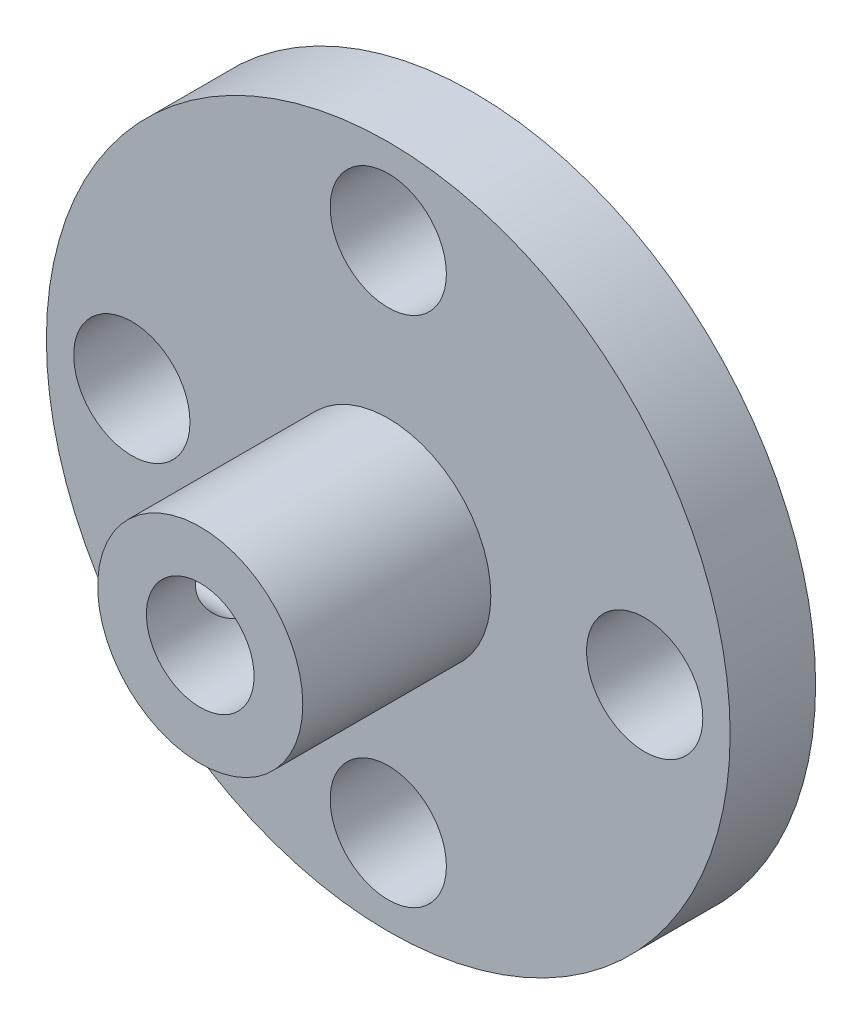
ISO-10303-21;
HEADER;
FILE_DESCRIPTION(('STEP AP214'),'2;1');
FILE_NAME('part.step','',(''),(''),'','','');
FILE_SCHEMA(('AUTOMOTIVE_DESIGN { 1 0 10303 214 1 1 1 1 }'));
ENDSEC;
DATA;
#1=APPLICATION_CONTEXT('core data for automotive mechanical design processes');
#2=APPLICATION_PROTOCOL_DEFINITION('international standard','automotive_design',2000,#1);
#3=PRODUCT_CONTEXT('',#1,'mechanical');
#4=PRODUCT('Part','Part','',(#3));
#5=PRODUCT_RELATED_PRODUCT_CATEGORY('part','',(#4));
#6=PRODUCT_DEFINITION_FORMATION('','',#4);
#7=PRODUCT_DEFINITION_CONTEXT('part definition',#1,'design');
#8=PRODUCT_DEFINITION('design','',#6,#7);
#9=PRODUCT_DEFINITION_SHAPE('','',#8);
#10=(LENGTH_UNIT() NAMED_UNIT(*) SI_UNIT(.MILLI.,.METRE.));
#11=(NAMED_UNIT(*) PLANE_ANGLE_UNIT() SI_UNIT($,.RADIAN.));
#12=(NAMED_UNIT(*) SI_UNIT($,.STERADIAN.) SOLID_ANGLE_UNIT());
#13=UNCERTAINTY_MEASURE_WITH_UNIT(LENGTH_MEASURE(1.E-05),#10,'distance_accuracy_value','');
#14=(GEOMETRIC_REPRESENTATION_CONTEXT(3) GLOBAL_UNCERTAINTY_ASSIGNED_CONTEXT((#13)) GLOBAL_UNIT_ASSIGNED_CONTEXT((#10,
#11,#12)) REPRESENTATION_CONTEXT('',''));
#15=CARTESIAN_POINT('',(0.,0.,0.));
#16=DIRECTION('',(0.,0.,1.));
#17=DIRECTION('',(1.,0.,0.));
#18=AXIS2_PLACEMENT_3D('',#15,#16,#17);
#19=CARTESIAN_POINT('',(0.,0.,3.175));
#20=DIRECTION('',(0.,0.,1.));
#21=DIRECTION('',(1.,0.,0.));
#22=AXIS2_PLACEMENT_3D('',#19,#20,#21);
#23=PLANE('',#22);
#24=CARTESIAN_POINT('',(0.,0.,3.175));
#25=DIRECTION('',(0.,0.,1.));
#26=DIRECTION('',(1.,0.,0.));
#27=AXIS2_PLACEMENT_3D('',#24,#25,#26);
#28=CIRCLE('',#27,12.7);
#29=CARTESIAN_POINT('',(12.7,0.,3.175));
#30=VERTEX_POINT('',#29);
#31=EDGE_CURVE('E11',#30,#30,#28,.T.);
#32=ORIENTED_EDGE('',*,*,#31,.T.);
#33=EDGE_LOOP('',(#32));
#34=FACE_BOUND('',#33,.T.);
#35=CARTESIAN_POINT('',(0.,9.525,3.175));
#36=DIRECTION('',(0.,0.,1.));
#37=DIRECTION('',(1.,0.,0.));
#38=AXIS2_PLACEMENT_3D('',#35,#36,#37);
#39=CIRCLE('',#38,2.159);
#40=CARTESIAN_POINT('',(2.159,9.525,3.175));
#41=VERTEX_POINT('',#40);
#42=EDGE_CURVE('E63',#41,#41,#39,.T.);
#43=ORIENTED_EDGE('',*,*,#42,.F.);
#44=EDGE_LOOP('',(#43));
#45=FACE_BOUND('',#44,.T.);
#46=CARTESIAN_POINT('',(9.52500000000027,2.68967068210316E-13,3.175));
#47=DIRECTION('',(0.,0.,1.));
#48=DIRECTION('',(1.,0.,0.));
#49=AXIS2_PLACEMENT_3D('',#46,#47,#48);
#50=CIRCLE('',#49,2.15900000000021);
#51=CARTESIAN_POINT('',(11.6840000000005,2.68967068210316E-13,3.175));
#52=VERTEX_POINT('',#51);
#53=EDGE_CURVE('E69',#52,#52,#50,.T.);
#54=ORIENTED_EDGE('',*,*,#53,.F.);
#55=EDGE_LOOP('',(#54));
#56=FACE_BOUND('',#55,.T.);
#57=CARTESIAN_POINT('',(5.37934136420633E-13,-9.525,3.175));
#58=DIRECTION('',(0.,0.,1.));
#59=DIRECTION('',(1.,0.,0.));
#60=AXIS2_PLACEMENT_3D('',#57,#58,#59);
#61=CIRCLE('',#60,2.15900000000058);
#62=CARTESIAN_POINT('',(2.15900000000112,-9.525,3.175));
#63=VERTEX_POINT('',#62);
#64=EDGE_CURVE('E97',#63,#63,#61,.T.);
#65=ORIENTED_EDGE('',*,*,#64,.F.);
#66=EDGE_LOOP('',(#65));
#67=FACE_BOUND('',#66,.T.);
#68=CARTESIAN_POINT('',(-9.52499999999973,-2.70133544286504E-13,3.175));
#69=DIRECTION('',(0.,0.,1.));
#70=DIRECTION('',(1.,0.,0.));
#71=AXIS2_PLACEMENT_3D('',#68,#69,#70);
#72=CIRCLE('',#71,2.15900000000043);
#73=CARTESIAN_POINT('',(-7.3659999999993,-2.70133544286504E-13,3.175));
#74=VERTEX_POINT('',#73);
#75=EDGE_CURVE('E92',#74,#74,#72,.T.);
#76=ORIENTED_EDGE('',*,*,#75,.F.);
#77=EDGE_LOOP('',(#76));
#78=FACE_BOUND('',#77,.T.);
#79=CARTESIAN_POINT('',(0.,0.,3.175));
#80=DIRECTION('',(0.,0.,1.));
#81=DIRECTION('',(1.,0.,0.));
#82=AXIS2_PLACEMENT_3D('',#79,#80,#81);
#83=CIRCLE('',#82,3.81);
#84=CARTESIAN_POINT('',(3.81,0.,3.175));
#85=VERTEX_POINT('',#84);
#86=EDGE_CURVE('E78',#85,#85,#83,.T.);
#87=ORIENTED_EDGE('',*,*,#86,.F.);
#88=EDGE_LOOP('',(#87));
#89=FACE_BOUND('',#88,.T.);
#90=ADVANCED_FACE('F49',(#34,#45,#56,#67,#78,#89),#23,.T.);
#91=CARTESIAN_POINT('',(0.,0.,0.));
#92=DIRECTION('',(0.,0.,1.));
#93=DIRECTION('',(1.,0.,0.));
#94=AXIS2_PLACEMENT_3D('',#91,#92,#93);
#95=PLANE('',#94);
#96=CARTESIAN_POINT('',(0.,0.,0.));
#97=DIRECTION('',(0.,0.,1.));
#98=DIRECTION('',(1.,0.,0.));
#99=AXIS2_PLACEMENT_3D('',#96,#97,#98);
#100=CIRCLE('',#99,12.7);
#101=CARTESIAN_POINT('',(12.7,0.,0.));
#102=VERTEX_POINT('',#101);
#103=EDGE_CURVE('E89',#102,#102,#100,.T.);
#104=ORIENTED_EDGE('',*,*,#103,.F.);
#105=EDGE_LOOP('',(#104));
#106=FACE_BOUND('',#105,.T.);
#107=CARTESIAN_POINT('',(0.,9.525,0.));
#108=DIRECTION('',(0.,0.,1.));
#109=DIRECTION('',(1.,0.,0.));
#110=AXIS2_PLACEMENT_3D('',#107,#108,#109);
#111=CIRCLE('',#110,2.159);
#112=CARTESIAN_POINT('',(2.159,9.525,0.));
#113=VERTEX_POINT('',#112);
#114=EDGE_CURVE('E86',#113,#113,#111,.T.);
#115=ORIENTED_EDGE('',*,*,#114,.T.);
#116=EDGE_LOOP('',(#115));
#117=FACE_BOUND('',#116,.T.);
#118=CARTESIAN_POINT('',(9.52500000000027,2.68967068210316E-13,0.));
#119=DIRECTION('',(0.,0.,1.));
#120=DIRECTION('',(1.,0.,0.));
#121=AXIS2_PLACEMENT_3D('',#118,#119,#120);
#122=CIRCLE('',#121,2.15900000000021);
#123=CARTESIAN_POINT('',(11.6840000000005,2.68967068210316E-13,0.));
#124=VERTEX_POINT('',#123);
#125=EDGE_CURVE('E82',#124,#124,#122,.T.);
#126=ORIENTED_EDGE('',*,*,#125,.T.);
#127=EDGE_LOOP('',(#126));
#128=FACE_BOUND('',#127,.T.);
#129=CARTESIAN_POINT('',(5.37934136420633E-13,-9.525,0.));
#130=DIRECTION('',(0.,0.,1.));
#131=DIRECTION('',(1.,0.,0.));
#132=AXIS2_PLACEMENT_3D('',#129,#130,#131);
#133=CIRCLE('',#132,2.15900000000058);
#134=CARTESIAN_POINT('',(2.15900000000112,-9.525,0.));
#135=VERTEX_POINT('',#134);
#136=EDGE_CURVE('E77',#135,#135,#133,.T.);
#137=ORIENTED_EDGE('',*,*,#136,.T.);
#138=EDGE_LOOP('',(#137));
#139=FACE_BOUND('',#138,.T.);
#140=CARTESIAN_POINT('',(-9.52499999999973,-2.70133544286504E-13,0.));
#141=DIRECTION('',(0.,0.,1.));
#142=DIRECTION('',(1.,0.,0.));
#143=AXIS2_PLACEMENT_3D('',#140,#141,#142);
#144=CIRCLE('',#143,2.15900000000043);
#145=CARTESIAN_POINT('',(-7.3659999999993,-2.70133544286504E-13,0.));
#146=VERTEX_POINT('',#145);
#147=EDGE_CURVE('E73',#146,#146,#144,.T.);
#148=ORIENTED_EDGE('',*,*,#147,.T.);
#149=EDGE_LOOP('',(#148));
#150=FACE_BOUND('',#149,.T.);
#151=CARTESIAN_POINT('',(0.,0.,0.));
#152=DIRECTION('',(0.,0.,1.));
#153=DIRECTION('',(1.,0.,0.));
#154=AXIS2_PLACEMENT_3D('',#151,#152,#153);
#155=CIRCLE('',#154,2.);
#156=CARTESIAN_POINT('',(2.,0.,0.));
#157=VERTEX_POINT('',#156);
#158=EDGE_CURVE('E133',#157,#157,#155,.T.);
#159=ORIENTED_EDGE('',*,*,#158,.T.);
#160=EDGE_LOOP('',(#159));
#161=FACE_BOUND('',#160,.T.);
#162=ADVANCED_FACE('F115',(#106,#117,#128,#139,#150,#161),#95,.F.);
#163=CARTESIAN_POINT('',(0.,9.525,3.175));
#164=DIRECTION('',(0.,0.,-1.));
#165=DIRECTION('',(-1.,0.,0.));
#166=AXIS2_PLACEMENT_3D('',#163,#164,#165);
#167=CYLINDRICAL_SURFACE('',#166,2.159);
#168=ORIENTED_EDGE('',*,*,#42,.T.);
#169=EDGE_LOOP('',(#168));
#170=FACE_BOUND('',#169,.T.);
#171=ORIENTED_EDGE('',*,*,#114,.F.);
#172=EDGE_LOOP('',(#171));
#173=FACE_BOUND('',#172,.T.);
#174=ADVANCED_FACE('F187',(#170,#173),#167,.F.);
#175=CARTESIAN_POINT('',(9.52500000000027,2.68967068210316E-13,3.175));
#176=DIRECTION('',(0.,0.,-1.));
#177=DIRECTION('',(-1.,0.,0.));
#178=AXIS2_PLACEMENT_3D('',#175,#176,#177);
#179=CYLINDRICAL_SURFACE('',#178,2.15900000000021);
#180=ORIENTED_EDGE('',*,*,#53,.T.);
#181=EDGE_LOOP('',(#180));
#182=FACE_BOUND('',#181,.T.);
#183=ORIENTED_EDGE('',*,*,#125,.F.);
#184=EDGE_LOOP('',(#183));
#185=FACE_BOUND('',#184,.T.);
#186=ADVANCED_FACE('F110',(#182,#185),#179,.F.);
#187=CARTESIAN_POINT('',(5.37934136420633E-13,-9.525,3.175));
#188=DIRECTION('',(0.,0.,-1.));
#189=DIRECTION('',(-1.,0.,0.));
#190=AXIS2_PLACEMENT_3D('',#187,#188,#189);
#191=CYLINDRICAL_SURFACE('',#190,2.15900000000058);
#192=ORIENTED_EDGE('',*,*,#64,.T.);
#193=EDGE_LOOP('',(#192));
#194=FACE_BOUND('',#193,.T.);
#195=ORIENTED_EDGE('',*,*,#136,.F.);
#196=EDGE_LOOP('',(#195));
#197=FACE_BOUND('',#196,.T.);
#198=ADVANCED_FACE('F184',(#194,#197),#191,.F.);
#199=CARTESIAN_POINT('',(-9.52499999999973,-2.70133544286504E-13,3.175));
#200=DIRECTION('',(0.,0.,-1.));
#201=DIRECTION('',(-1.,0.,0.));
#202=AXIS2_PLACEMENT_3D('',#199,#200,#201);
#203=CYLINDRICAL_SURFACE('',#202,2.15900000000043);
#204=ORIENTED_EDGE('',*,*,#75,.T.);
#205=EDGE_LOOP('',(#204));
#206=FACE_BOUND('',#205,.T.);
#207=ORIENTED_EDGE('',*,*,#147,.F.);
#208=EDGE_LOOP('',(#207));
#209=FACE_BOUND('',#208,.T.);
#210=ADVANCED_FACE('F51',(#206,#209),#203,.F.);
#211=CARTESIAN_POINT('',(0.,0.,3.175));
#212=DIRECTION('',(0.,0.,-1.));
#213=DIRECTION('',(-1.,0.,0.));
#214=AXIS2_PLACEMENT_3D('',#211,#212,#213);
#215=CYLINDRICAL_SURFACE('',#214,12.7);
#216=ORIENTED_EDGE('',*,*,#31,.F.);
#217=EDGE_LOOP('',(#216));
#218=FACE_BOUND('',#217,.T.);
#219=ORIENTED_EDGE('',*,*,#103,.T.);
#220=EDGE_LOOP('',(#219));
#221=FACE_BOUND('',#220,.T.);
#222=ADVANCED_FACE('F168',(#218,#221),#215,.T.);
#223=CARTESIAN_POINT('',(0.,0.,10.16));
#224=DIRECTION('',(0.,0.,-1.));
#225=DIRECTION('',(-1.,0.,0.));
#226=AXIS2_PLACEMENT_3D('',#223,#224,#225);
#227=CYLINDRICAL_SURFACE('',#226,2.);
#228=CARTESIAN_POINT('',(-2.,0.,8.335));
#229=CARTESIAN_POINT('',(-1.99999779170123,-0.0676282271040757,8.33499771331462));
#230=CARTESIAN_POINT('',(-1.99653849291545,-0.135277659027154,8.32988780934711));
#231=CARTESIAN_POINT('',(-1.9830373770726,-0.268425093843265,8.30976087565858));
#232=CARTESIAN_POINT('',(-1.97299028345689,-0.333921327913897,8.29473590430542));
#233=CARTESIAN_POINT('',(-1.94730383170857,-0.460618858768333,8.25571094861015));
#234=CARTESIAN_POINT('',(-1.93169181476083,-0.521839434022001,8.23175481824332));
#235=CARTESIAN_POINT('',(-1.8961212428857,-0.639128781225901,8.17589831626531));
#236=CARTESIAN_POINT('',(-1.87616226529362,-0.695197051451668,8.14399717209936));
#237=CARTESIAN_POINT('',(-1.83144422461706,-0.806028503427509,8.0701846937779));
#238=CARTESIAN_POINT('',(-1.80642024000079,-0.860266914399406,8.02764931355256));
#239=CARTESIAN_POINT('',(-1.75472774937108,-0.961332662708084,7.9352819444714));
#240=CARTESIAN_POINT('',(-1.7280568868781,-1.00814902177539,7.8854393529796));
#241=CARTESIAN_POINT('',(-1.67081342550614,-1.10081873784949,7.77049660944055));
#242=CARTESIAN_POINT('',(-1.64031016741129,-1.14528243433217,7.70423308271313));
#243=CARTESIAN_POINT('',(-1.58366940930257,-1.22240751214924,7.56347427809018));
#244=CARTESIAN_POINT('',(-1.55752441924661,-1.25508925654294,7.48899349619912));
#245=CARTESIAN_POINT('',(-1.52063899147661,-1.29931941189116,7.35598327389377));
#246=CARTESIAN_POINT('',(-1.50762947447479,-1.31425715875283,7.29921686527258));
#247=CARTESIAN_POINT('',(-1.48779848964415,-1.33666933815973,7.18321727543935));
#248=CARTESIAN_POINT('',(-1.48096611635565,-1.34415692597381,7.12398863537873));
#249=CARTESIAN_POINT('',(-1.47455099802662,-1.35119437276987,7.00438251712775));
#250=CARTESIAN_POINT('',(-1.47500082691156,-1.35070856592824,6.94400108439909));
#251=CARTESIAN_POINT('',(-1.48315319533032,-1.34174844845213,6.82431789680339));
#252=CARTESIAN_POINT('',(-1.49086102008152,-1.33326831640572,6.76501696082573));
#253=CARTESIAN_POINT('',(-1.51176576448829,-1.30950178176604,6.6520146788774));
#254=CARTESIAN_POINT('',(-1.52467333361019,-1.2945715445238,6.59818140362412));
#255=CARTESIAN_POINT('',(-1.55445372494255,-1.25865711084108,6.49373919190826));
#256=CARTESIAN_POINT('',(-1.57132959757272,-1.23766825432441,6.44313277415128));
#257=CARTESIAN_POINT('',(-1.6162777869568,-1.1788079681238,6.32215953534017));
#258=CARTESIAN_POINT('',(-1.64584272203452,-1.13766449285112,6.25392977314792));
#259=CARTESIAN_POINT('',(-1.70650325518769,-1.04448501661969,6.12603137335075));
#260=CARTESIAN_POINT('',(-1.73760155105273,-0.992429252698238,6.06637860438136));
#261=CARTESIAN_POINT('',(-1.79829635223503,-0.877711470793911,5.95616818703657));
#262=CARTESIAN_POINT('',(-1.82787885095596,-0.814967924663955,5.90568712736039));
#263=CARTESIAN_POINT('',(-1.88221497764854,-0.6800918987866,5.816025473977));
#264=CARTESIAN_POINT('',(-1.9069785053695,-0.607979186017681,5.77682163215482));
#265=CARTESIAN_POINT('',(-1.94428125162736,-0.472806880088533,5.71886334451706));
#266=CARTESIAN_POINT('',(-1.95831290266027,-0.411274629468529,5.69750351637255));
#267=CARTESIAN_POINT('',(-1.98065736207628,-0.284795243935582,5.66376369867151));
#268=CARTESIAN_POINT('',(-1.98897400584289,-0.219850430788237,5.65137768641707));
#269=CARTESIAN_POINT('',(-1.99915259880798,-0.0881207029273198,5.63624392538706));
#270=CARTESIAN_POINT('',(-2.00099379445717,-0.0213305619987398,5.63352716584268));
#271=CARTESIAN_POINT('',(-1.99798370769555,0.11176803940126,5.63798787724396));
#272=CARTESIAN_POINT('',(-1.99313195663853,0.178076465815762,5.64516604104114));
#273=CARTESIAN_POINT('',(-1.97760577751886,0.304885193982272,5.66837795058816));
#274=CARTESIAN_POINT('',(-1.96723636635373,0.365509897100455,5.68394831030888));
#275=CARTESIAN_POINT('',(-1.94170712217466,0.483112990273982,5.72288193403299));
#276=CARTESIAN_POINT('',(-1.92654641449173,0.54009071227373,5.7462466209631));
#277=CARTESIAN_POINT('',(-1.89107461360941,0.653974733101366,5.80213543828933));
#278=CARTESIAN_POINT('',(-1.87044114423664,0.710484978741783,5.83525751279239));
#279=CARTESIAN_POINT('',(-1.82625225659433,0.817408312640775,5.90863779522913));
#280=CARTESIAN_POINT('',(-1.80269451739019,0.867816494329826,5.94890168248845));
#281=CARTESIAN_POINT('',(-1.75016770369709,0.969912109903708,6.04300122195215));
#282=CARTESIAN_POINT('',(-1.72095005096077,1.0204193527657,6.09798031958262));
#283=CARTESIAN_POINT('',(-1.66329794845258,1.11191867803613,6.21577859787393));
#284=CARTESIAN_POINT('',(-1.6348637701157,1.15290749842426,6.27860045498777));
#285=CARTESIAN_POINT('',(-1.58591479837461,1.21914393627284,6.40163299292659));
#286=CARTESIAN_POINT('',(-1.5648509028817,1.24582446225904,6.46084949712787));
#287=CARTESIAN_POINT('',(-1.52804581172883,1.2907066123836,6.58394232472528));
#288=CARTESIAN_POINT('',(-1.51229420952745,1.30892484052073,6.6478092360646));
#289=CARTESIAN_POINT('',(-1.49040462854724,1.33376435408259,6.76874458456374));
#290=CARTESIAN_POINT('',(-1.48315262210532,1.34174842630907,6.82532590287263));
#291=CARTESIAN_POINT('',(-1.47524242523768,1.35044375433453,6.93948815152956));
#292=CARTESIAN_POINT('',(-1.47457903978374,1.35116074013065,6.99706825845328));
#293=CARTESIAN_POINT('',(-1.47994147670539,1.34528294055843,7.111465041456));
#294=CARTESIAN_POINT('',(-1.48596087967421,1.33869517205737,7.1682823972045));
#295=CARTESIAN_POINT('',(-1.50377847368539,1.31864533789349,7.27977768136163));
#296=CARTESIAN_POINT('',(-1.51558463681271,1.30517378775093,7.33445254564232));
#297=CARTESIAN_POINT('',(-1.54812054846541,1.26654898466073,7.45808930946022));
#298=CARTESIAN_POINT('',(-1.57050651130463,1.23901482226524,7.52586554218861));
#299=CARTESIAN_POINT('',(-1.61949032322796,1.17426514297033,7.65495230533347));
#300=CARTESIAN_POINT('',(-1.64609445047456,1.13703514120721,7.71625296748005));
#301=CARTESIAN_POINT('',(-1.70113617266383,1.05295301285826,7.83297266151239));
#302=CARTESIAN_POINT('',(-1.72959911857046,1.00593031198615,7.88825661631667));
#303=CARTESIAN_POINT('',(-1.78535455312654,0.90328436603997,7.99090532359869));
#304=CARTESIAN_POINT('',(-1.8126467374368,0.847658901778966,8.03826802611321));
#305=CARTESIAN_POINT('',(-1.86664983651361,0.721681434030674,8.12882961201791));
#306=CARTESIAN_POINT('',(-1.89295279599895,0.65037765508775,8.1709669268096));
#307=CARTESIAN_POINT('',(-1.93824300346185,0.499378379346407,8.241994645589));
#308=CARTESIAN_POINT('',(-1.95724724071721,0.41970292723455,8.27091584299636));
#309=CARTESIAN_POINT('',(-1.98069412894931,0.282721329013209,8.30626989937003));
#310=CARTESIAN_POINT('',(-1.98788795561871,0.226965641759603,8.31700056539478));
#311=CARTESIAN_POINT('',(-1.99754097338308,0.114144686625059,8.33136530714285));
#312=CARTESIAN_POINT('',(-2.00000186385878,0.0570798962331294,8.33500193001902));
#313=CARTESIAN_POINT('',(-2.,0.,8.335));
#314=B_SPLINE_CURVE_WITH_KNOTS('',3,(#228,#229,#230,#231,#232,#233,#234,#235,#236,#237,#238,
#239,#240,#241,#242,#243,#244,#245,#246,#247,#248,#249,#250,#251,#252,#253,#254,#255,#256,#257,
#258,#259,#260,#261,#262,#263,#264,#265,#266,#267,#268,#269,#270,#271,#272,#273,#274,#275,#276,
#277,#278,#279,#280,#281,#282,#283,#284,#285,#286,#287,#288,#289,#290,#291,#292,#293,#294,#295,
#296,#297,#298,#299,#300,#301,#302,#303,#304,#305,#306,#307,#308,#309,#310,#311,#312,#313),
.UNSPECIFIED.,.T.,.F.,(4,2,2,2,2,2,2,2,2,2,2,2,2,2,2,2,2,2,2,2,2,2,2,2,2,2,2,2,2,2,2,2,2,2,2,2,
2,2,2,2,2,2,4),(0.,0.202651464163277,0.405465442599549,0.607296401705931,0.809146994055782,
1.02831710184136,1.24780842813815,1.50292539701382,1.75759930234986,1.93726294016847,
2.11660876728147,2.29675704471727,2.477036606288,2.64842825957878,2.81995209416526,
3.07358269375797,3.32767666824589,3.58380364628826,3.83939876824866,4.03843994393392,
4.2373474108205,4.43689179006303,4.63645014229378,4.82597510880705,5.0155346938126,
5.2207800233876,5.42618930631758,5.66574299706562,5.90537866353734,6.10947965323964,
6.3131784638987,6.48520267545972,6.65709123774732,6.82881482868606,7.00077566105652,
7.22905726038459,7.45768187153473,7.69068363076875,7.92374559619129,8.1829279004951,
8.44150319435653,8.61260748921184,8.78365033686967),.UNSPECIFIED.);
#315=CARTESIAN_POINT('',(-2.,0.,8.335));
#316=VERTEX_POINT('',#315);
#317=EDGE_CURVE('E138',#316,#316,#314,.T.);
#318=ORIENTED_EDGE('',*,*,#317,.F.);
#319=EDGE_LOOP('',(#318));
#320=FACE_BOUND('',#319,.T.);
#321=CARTESIAN_POINT('',(0.,0.,10.16));
#322=DIRECTION('',(0.,0.,1.));
#323=DIRECTION('',(1.,0.,0.));
#324=AXIS2_PLACEMENT_3D('',#321,#322,#323);
#325=CIRCLE('',#324,2.);
#326=CARTESIAN_POINT('',(2.,0.,10.16));
#327=VERTEX_POINT('',#326);
#328=EDGE_CURVE('E127',#327,#327,#325,.T.);
#329=ORIENTED_EDGE('',*,*,#328,.T.);
#330=EDGE_LOOP('',(#329));
#331=FACE_BOUND('',#330,.T.);
#332=ORIENTED_EDGE('',*,*,#158,.F.);
#333=EDGE_LOOP('',(#332));
#334=FACE_BOUND('',#333,.T.);
#335=ADVANCED_FACE('F151',(#320,#331,#334),#227,.F.);
#336=CARTESIAN_POINT('',(0.,0.,10.16));
#337=DIRECTION('',(0.,0.,-1.));
#338=DIRECTION('',(-1.,0.,0.));
#339=AXIS2_PLACEMENT_3D('',#336,#337,#338);
#340=CYLINDRICAL_SURFACE('',#339,3.81);
#341=CARTESIAN_POINT('',(-3.81,0.,8.335));
#342=CARTESIAN_POINT('',(-3.81000097638546,-0.0733906685766089,8.33500137034603));
#343=CARTESIAN_POINT('',(-3.80786042556386,-0.14677156107298,8.32899621472365));
#344=CARTESIAN_POINT('',(-3.79953362163934,-0.291356058377059,8.30521927752224));
#345=CARTESIAN_POINT('',(-3.79334745508817,-0.362559709730467,8.28744774767246));
#346=CARTESIAN_POINT('',(-3.77759763849874,-0.500684395085561,8.24083480573473));
#347=CARTESIAN_POINT('',(-3.76804006956238,-0.567612885291789,8.21201331671848));
#348=CARTESIAN_POINT('',(-3.74651126619384,-0.695683685403511,8.14421420301865));
#349=CARTESIAN_POINT('',(-3.7345394651824,-0.756824632112393,8.105234193674));
#350=CARTESIAN_POINT('',(-3.70891462646797,-0.873940704912064,8.01665119089049));
#351=CARTESIAN_POINT('',(-3.69521763317504,-0.929662605680299,7.96672621913636));
#352=CARTESIAN_POINT('',(-3.66791512056369,-1.03214167961795,7.85835435787943));
#353=CARTESIAN_POINT('',(-3.65430962594648,-1.07889651891586,7.79990525673732));
#354=CARTESIAN_POINT('',(-3.62823353622555,-1.16363944028693,7.67376973148485));
#355=CARTESIAN_POINT('',(-3.61581570082831,-1.20128443875651,7.60584083124166));
#356=CARTESIAN_POINT('',(-3.59419692437244,-1.26450507911786,7.46410555711273));
#357=CARTESIAN_POINT('',(-3.58499485474922,-1.2900849563367,7.39030125637061));
#358=CARTESIAN_POINT('',(-3.57131578130404,-1.32747465909481,7.24180918267643));
#359=CARTESIAN_POINT('',(-3.56667498416927,-1.33976354978229,7.16725760256022));
#360=CARTESIAN_POINT('',(-3.56216178653321,-1.3517204820843,7.01701724281686));
#361=CARTESIAN_POINT('',(-3.56228767829303,-1.35139304369011,6.94132888017371));
#362=CARTESIAN_POINT('',(-3.56715122223268,-1.33849576284562,6.795190100443));
#363=CARTESIAN_POINT('',(-3.57164634307436,-1.32656972676471,6.72467334648524));
#364=CARTESIAN_POINT('',(-3.58434195324426,-1.29187093805301,6.58671562618508));
#365=CARTESIAN_POINT('',(-3.59254294098873,-1.26909672638724,6.51927507491663));
#366=CARTESIAN_POINT('',(-3.61188565133565,-1.21296063439395,6.38799595378979));
#367=CARTESIAN_POINT('',(-3.62307649098014,-1.17941983297647,6.32424144498645));
#368=CARTESIAN_POINT('',(-3.64711946785948,-1.1028270244331,6.20307034059894));
#369=CARTESIAN_POINT('',(-3.65997213244658,-1.05977199503826,6.14565576765585));
#370=CARTESIAN_POINT('',(-3.68682438783227,-0.962352827006063,6.03520222628202));
#371=CARTESIAN_POINT('',(-3.70084672338437,-0.907468291331746,5.982626742538));
#372=CARTESIAN_POINT('',(-3.72779522898407,-0.789493329468497,5.88729676894652));
#373=CARTESIAN_POINT('',(-3.74072126464373,-0.726401899647236,5.84454348204072));
#374=CARTESIAN_POINT('',(-3.76423093997788,-0.592723928163789,5.76963227185212));
#375=CARTESIAN_POINT('',(-3.77478332917442,-0.52205366482267,5.73761325566955));
#376=CARTESIAN_POINT('',(-3.79212773687363,-0.375864443098374,5.6860672286432));
#377=CARTESIAN_POINT('',(-3.79892123911729,-0.300347411029667,5.66653528831682));
#378=CARTESIAN_POINT('',(-3.80772923074071,-0.150520852811074,5.64137309327259));
#379=CARTESIAN_POINT('',(-3.80995845876991,-0.0763288241845148,5.6351176500414));
#380=CARTESIAN_POINT('',(-3.81004035054016,0.0720688371663771,5.63488571043188));
#381=CARTESIAN_POINT('',(-3.80789386379829,0.146274464453918,5.64090683063718));
#382=CARTESIAN_POINT('',(-3.79960743921971,0.289993188986411,5.66457136105856));
#383=CARTESIAN_POINT('',(-3.79360377619412,0.359580202933394,5.6818184194038));
#384=CARTESIAN_POINT('',(-3.77834277620231,0.494835041105048,5.72693684584096));
#385=CARTESIAN_POINT('',(-3.76908501728392,0.560502355777673,5.7548095917844));
#386=CARTESIAN_POINT('',(-3.74792063377632,0.68810864030988,5.82124500706537));
#387=CARTESIAN_POINT('',(-3.73594709362569,0.749891714548487,5.86008516518877));
#388=CARTESIAN_POINT('',(-3.71069351184833,0.866259174773536,5.94703335277513));
#389=CARTESIAN_POINT('',(-3.69741302838298,0.920841111572176,5.99514452179396));
#390=CARTESIAN_POINT('',(-3.67016677387747,1.02419754728447,6.10220001443562));
#391=CARTESIAN_POINT('',(-3.65620102602558,1.07252665519896,6.16157543479661));
#392=CARTESIAN_POINT('',(-3.62984353023762,1.15860640329995,6.28788345256797));
#393=CARTESIAN_POINT('',(-3.61745185038068,1.19635658602841,6.35481637660735));
#394=CARTESIAN_POINT('',(-3.59573823884429,1.26012234646062,6.49459839556644));
#395=CARTESIAN_POINT('',(-3.58641828283268,1.28613037582075,6.56745126066879));
#396=CARTESIAN_POINT('',(-3.57210741715349,1.32536532461213,6.7169174872229));
#397=CARTESIAN_POINT('',(-3.56711421157644,1.33859902292947,6.79352883147494));
#398=CARTESIAN_POINT('',(-3.56230534846459,1.35134096320304,6.94357064660968));
#399=CARTESIAN_POINT('',(-3.5622071496104,1.35159822026766,7.01692907440093));
#400=CARTESIAN_POINT('',(-3.56648808938116,1.34026065227766,7.16258419595111));
#401=CARTESIAN_POINT('',(-3.57086689039243,1.32866672092941,7.23488096935311));
#402=CARTESIAN_POINT('',(-3.58338539019222,1.2945135679615,7.37459390719399));
#403=CARTESIAN_POINT('',(-3.59143113683991,1.27222758135778,7.44208597188643));
#404=CARTESIAN_POINT('',(-3.61033200825891,1.21755305207654,7.57241984369123));
#405=CARTESIAN_POINT('',(-3.62118780316242,1.18516209921728,7.63526053695484));
#406=CARTESIAN_POINT('',(-3.64513645422303,1.10938248067904,7.75779133947942));
#407=CARTESIAN_POINT('',(-3.65831183987137,1.0655394813714,7.81718418569019));
#408=CARTESIAN_POINT('',(-3.68510128017687,0.968836036210471,7.92801052338846));
#409=CARTESIAN_POINT('',(-3.69871546543117,0.915972885265257,7.97944161834176));
#410=CARTESIAN_POINT('',(-3.72560350605751,0.799805201836982,8.07529261831779));
#411=CARTESIAN_POINT('',(-3.73883262179952,0.736131257790563,8.11927914093831));
#412=CARTESIAN_POINT('',(-3.76278249840338,0.601841309203318,8.19589236888518));
#413=CARTESIAN_POINT('',(-3.77350350582837,0.531225988014521,8.22852019099875));
#414=CARTESIAN_POINT('',(-3.79119643550178,0.385133568254542,8.28122097538468));
#415=CARTESIAN_POINT('',(-3.79817494413586,0.309665274350793,8.30131600421971));
#416=CARTESIAN_POINT('',(-3.80757535330368,0.15612697647303,8.32820229482917));
#417=CARTESIAN_POINT('',(-3.80999896152117,0.0780579587162575,8.33499854250662));
#418=CARTESIAN_POINT('',(-3.81,0.,8.335));
#419=B_SPLINE_CURVE_WITH_KNOTS('',3,(#341,#342,#343,#344,#345,#346,#347,#348,#349,#350,#351,
#352,#353,#354,#355,#356,#357,#358,#359,#360,#361,#362,#363,#364,#365,#366,#367,#368,#369,#370,
#371,#372,#373,#374,#375,#376,#377,#378,#379,#380,#381,#382,#383,#384,#385,#386,#387,#388,#389,
#390,#391,#392,#393,#394,#395,#396,#397,#398,#399,#400,#401,#402,#403,#404,#405,#406,#407,#408,
#409,#410,#411,#412,#413,#414,#415,#416,#417,#418),.UNSPECIFIED.,.T.,.F.,(4,2,2,2,2,2,2,2,2,2,2,
2,2,2,2,2,2,2,2,2,2,2,2,2,2,2,2,2,2,2,2,2,2,2,2,2,2,2,4),(0.,0.219884417148303,
0.439764130251916,0.65924925065405,0.878785940556478,1.10594876805755,1.33317063959539,
1.56794569685529,1.80263827748266,2.028556417176,2.25439361902161,2.46837109973642,
2.68237736767144,2.90014211344898,3.11797613359606,3.34876883427574,3.57958978549187,
3.81329174081721,4.04690138131617,4.26924122754789,4.49153791202904,4.70638307417875,
4.92125610515855,5.1421461262195,5.36311108184551,5.59548554452578,5.827870054084,
6.06040373808722,6.29281395673273,6.51179285807734,6.73075524728854,6.94439813508246,
7.15809201882885,7.38207227068936,7.60611981138366,7.8405124214034,8.07488197943308,
8.30883770792573,8.54270570625571),.UNSPECIFIED.);
#420=CARTESIAN_POINT('',(-3.81,0.,8.335));
#421=VERTEX_POINT('',#420);
#422=EDGE_CURVE('E53',#421,#421,#419,.T.);
#423=ORIENTED_EDGE('',*,*,#422,.T.);
#424=EDGE_LOOP('',(#423));
#425=FACE_BOUND('',#424,.T.);
#426=ORIENTED_EDGE('',*,*,#86,.T.);
#427=EDGE_LOOP('',(#426));
#428=FACE_BOUND('',#427,.T.);
#429=CARTESIAN_POINT('',(0.,0.,10.16));
#430=DIRECTION('',(0.,0.,1.));
#431=DIRECTION('',(1.,0.,0.));
#432=AXIS2_PLACEMENT_3D('',#429,#430,#431);
#433=CIRCLE('',#432,3.81);
#434=CARTESIAN_POINT('',(3.81,0.,10.16));
#435=VERTEX_POINT('',#434);
#436=EDGE_CURVE('E124',#435,#435,#433,.T.);
#437=ORIENTED_EDGE('',*,*,#436,.F.);
#438=EDGE_LOOP('',(#437));
#439=FACE_BOUND('',#438,.T.);
#440=ADVANCED_FACE('F160',(#425,#428,#439),#340,.T.);
#441=CARTESIAN_POINT('',(0.,0.,10.16));
#442=DIRECTION('',(0.,0.,1.));
#443=DIRECTION('',(1.,0.,0.));
#444=AXIS2_PLACEMENT_3D('',#441,#442,#443);
#445=PLANE('',#444);
#446=ORIENTED_EDGE('',*,*,#328,.F.);
#447=EDGE_LOOP('',(#446));
#448=FACE_BOUND('',#447,.T.);
#449=ORIENTED_EDGE('',*,*,#436,.T.);
#450=EDGE_LOOP('',(#449));
#451=FACE_BOUND('',#450,.T.);
#452=ADVANCED_FACE('F157',(#448,#451),#445,.T.);
#453=CARTESIAN_POINT('',(-12.7,0.,6.985));
#454=DIRECTION('',(1.,0.,0.));
#455=DIRECTION('',(0.,0.,-1.));
#456=AXIS2_PLACEMENT_3D('',#453,#454,#455);
#457=CYLINDRICAL_SURFACE('',#456,1.35);
#458=ORIENTED_EDGE('',*,*,#317,.T.);
#459=EDGE_LOOP('',(#458));
#460=FACE_BOUND('',#459,.T.);
#461=ORIENTED_EDGE('',*,*,#422,.F.);
#462=EDGE_LOOP('',(#461));
#463=FACE_BOUND('',#462,.T.);
#464=ADVANCED_FACE('F153',(#460,#463),#457,.F.);
#465=CLOSED_SHELL('',(#90,#162,#174,#186,#198,#210,#222,#335,#440,#452,#464));
#466=MANIFOLD_SOLID_BREP('B2',#465);
#467=ADVANCED_BREP_SHAPE_REPRESENTATION('',(#18,#466),#14);
#468=SHAPE_DEFINITION_REPRESENTATION(#9,#467);
ENDSEC;
END-ISO-10303-21;
